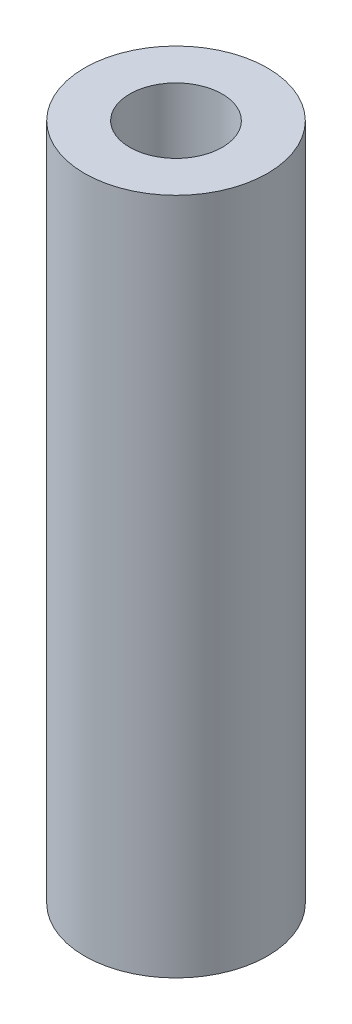
ISO-10303-21;
HEADER;
FILE_DESCRIPTION(('STEP AP214'),'2;1');
FILE_NAME('part.step','',(''),(''),'','','');
FILE_SCHEMA(('AUTOMOTIVE_DESIGN { 1 0 10303 214 1 1 1 1 }'));
ENDSEC;
DATA;
#1=APPLICATION_CONTEXT('core data for automotive mechanical design processes');
#2=APPLICATION_PROTOCOL_DEFINITION('international standard','automotive_design',2000,#1);
#3=PRODUCT_CONTEXT('',#1,'mechanical');
#4=PRODUCT('Part','Part','',(#3));
#5=PRODUCT_RELATED_PRODUCT_CATEGORY('part','',(#4));
#6=PRODUCT_DEFINITION_FORMATION('','',#4);
#7=PRODUCT_DEFINITION_CONTEXT('part definition',#1,'design');
#8=PRODUCT_DEFINITION('design','',#6,#7);
#9=PRODUCT_DEFINITION_SHAPE('','',#8);
#10=(LENGTH_UNIT() NAMED_UNIT(*) SI_UNIT(.MILLI.,.METRE.));
#11=(NAMED_UNIT(*) PLANE_ANGLE_UNIT() SI_UNIT($,.RADIAN.));
#12=(NAMED_UNIT(*) SI_UNIT($,.STERADIAN.) SOLID_ANGLE_UNIT());
#13=UNCERTAINTY_MEASURE_WITH_UNIT(LENGTH_MEASURE(1.E-05),#10,'distance_accuracy_value','');
#14=(GEOMETRIC_REPRESENTATION_CONTEXT(3) GLOBAL_UNCERTAINTY_ASSIGNED_CONTEXT((#13)) GLOBAL_UNIT_ASSIGNED_CONTEXT((#10,
#11,#12)) REPRESENTATION_CONTEXT('',''));
#15=CARTESIAN_POINT('',(0.,0.,0.));
#16=DIRECTION('',(0.,0.,1.));
#17=DIRECTION('',(1.,0.,0.));
#18=AXIS2_PLACEMENT_3D('',#15,#16,#17);
#19=CARTESIAN_POINT('',(0.,38.1,0.));
#20=DIRECTION('',(0.,1.,0.));
#21=DIRECTION('',(0.,0.,1.));
#22=AXIS2_PLACEMENT_3D('',#19,#20,#21);
#23=PLANE('',#22);
#24=CARTESIAN_POINT('',(0.,38.1,0.));
#25=DIRECTION('',(0.,1.,0.));
#26=DIRECTION('',(0.,0.,1.));
#27=AXIS2_PLACEMENT_3D('',#24,#25,#26);
#28=CIRCLE('',#27,5.14);
#29=CARTESIAN_POINT('',(0.,38.1,5.14));
#30=VERTEX_POINT('',#29);
#31=EDGE_CURVE('E10',#30,#30,#28,.T.);
#32=ORIENTED_EDGE('',*,*,#31,.T.);
#33=EDGE_LOOP('',(#32));
#34=FACE_BOUND('',#33,.T.);
#35=CARTESIAN_POINT('',(0.,38.1,0.));
#36=DIRECTION('',(0.,1.,0.));
#37=DIRECTION('',(0.,0.,1.));
#38=AXIS2_PLACEMENT_3D('',#35,#36,#37);
#39=CIRCLE('',#38,2.6);
#40=CARTESIAN_POINT('',(0.,38.1,2.6));
#41=VERTEX_POINT('',#40);
#42=EDGE_CURVE('E43',#41,#41,#39,.T.);
#43=ORIENTED_EDGE('',*,*,#42,.F.);
#44=EDGE_LOOP('',(#43));
#45=FACE_BOUND('',#44,.T.);
#46=ADVANCED_FACE('F32',(#34,#45),#23,.T.);
#47=CARTESIAN_POINT('',(0.,0.,0.));
#48=DIRECTION('',(0.,1.,0.));
#49=DIRECTION('',(0.,0.,1.));
#50=AXIS2_PLACEMENT_3D('',#47,#48,#49);
#51=PLANE('',#50);
#52=CARTESIAN_POINT('',(0.,0.,0.));
#53=DIRECTION('',(0.,1.,0.));
#54=DIRECTION('',(0.,0.,1.));
#55=AXIS2_PLACEMENT_3D('',#52,#53,#54);
#56=CIRCLE('',#55,5.14);
#57=CARTESIAN_POINT('',(0.,0.,5.14));
#58=VERTEX_POINT('',#57);
#59=EDGE_CURVE('E36',#58,#58,#56,.T.);
#60=ORIENTED_EDGE('',*,*,#59,.F.);
#61=EDGE_LOOP('',(#60));
#62=FACE_BOUND('',#61,.T.);
#63=CARTESIAN_POINT('',(0.,0.,0.));
#64=DIRECTION('',(0.,1.,0.));
#65=DIRECTION('',(0.,0.,1.));
#66=AXIS2_PLACEMENT_3D('',#63,#64,#65);
#67=CIRCLE('',#66,2.6);
#68=CARTESIAN_POINT('',(0.,0.,2.6));
#69=VERTEX_POINT('',#68);
#70=EDGE_CURVE('E45',#69,#69,#67,.T.);
#71=ORIENTED_EDGE('',*,*,#70,.T.);
#72=EDGE_LOOP('',(#71));
#73=FACE_BOUND('',#72,.T.);
#74=ADVANCED_FACE('F55',(#62,#73),#51,.F.);
#75=CARTESIAN_POINT('',(0.,38.1,0.));
#76=DIRECTION('',(0.,-1.,0.));
#77=DIRECTION('',(0.,0.,-1.));
#78=AXIS2_PLACEMENT_3D('',#75,#76,#77);
#79=CYLINDRICAL_SURFACE('',#78,5.14);
#80=ORIENTED_EDGE('',*,*,#31,.F.);
#81=EDGE_LOOP('',(#80));
#82=FACE_BOUND('',#81,.T.);
#83=ORIENTED_EDGE('',*,*,#59,.T.);
#84=EDGE_LOOP('',(#83));
#85=FACE_BOUND('',#84,.T.);
#86=ADVANCED_FACE('F34',(#82,#85),#79,.T.);
#87=CARTESIAN_POINT('',(0.,38.1,0.));
#88=DIRECTION('',(0.,-1.,0.));
#89=DIRECTION('',(0.,0.,-1.));
#90=AXIS2_PLACEMENT_3D('',#87,#88,#89);
#91=CYLINDRICAL_SURFACE('',#90,2.6);
#92=ORIENTED_EDGE('',*,*,#42,.T.);
#93=EDGE_LOOP('',(#92));
#94=FACE_BOUND('',#93,.T.);
#95=ORIENTED_EDGE('',*,*,#70,.F.);
#96=EDGE_LOOP('',(#95));
#97=FACE_BOUND('',#96,.T.);
#98=ADVANCED_FACE('F51',(#94,#97),#91,.F.);
#99=CLOSED_SHELL('',(#46,#74,#86,#98));
#100=MANIFOLD_SOLID_BREP('B2',#99);
#101=ADVANCED_BREP_SHAPE_REPRESENTATION('',(#18,#100),#14);
#102=SHAPE_DEFINITION_REPRESENTATION(#9,#101);
ENDSEC;
END-ISO-10303-21;
